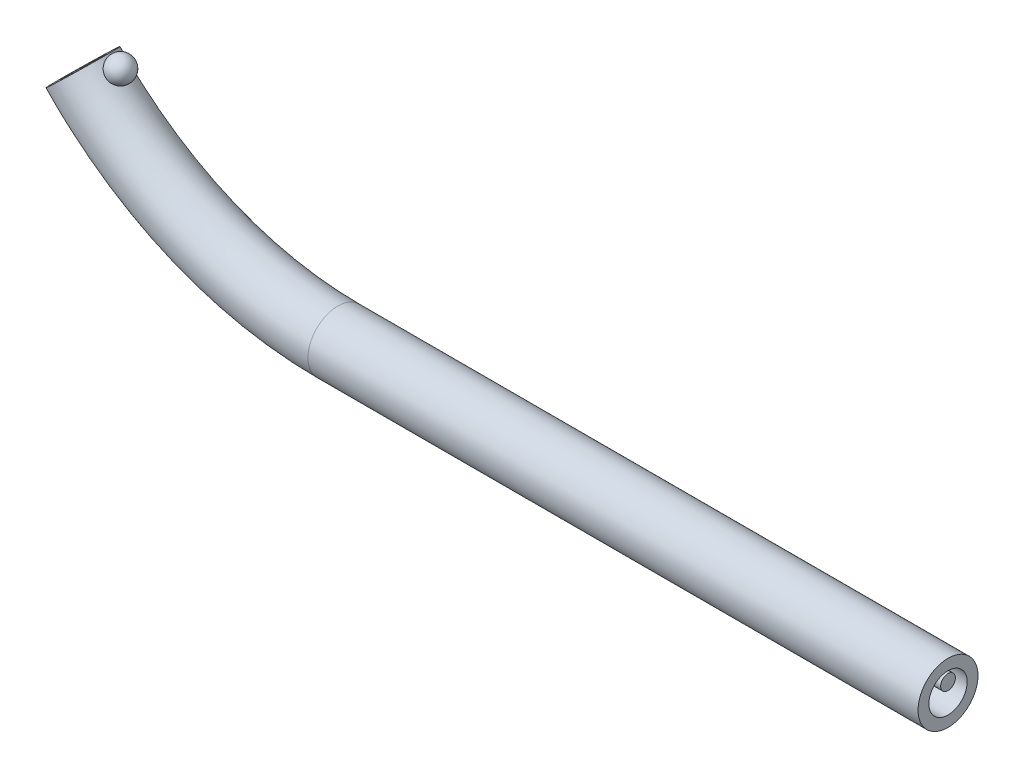
ISO-10303-21;
HEADER;
FILE_DESCRIPTION(('STEP AP214'),'2;1');
FILE_NAME('part.step','',(''),(''),'','','');
FILE_SCHEMA(('AUTOMOTIVE_DESIGN { 1 0 10303 214 1 1 1 1 }'));
ENDSEC;
DATA;
#1=APPLICATION_CONTEXT('core data for automotive mechanical design processes');
#2=APPLICATION_PROTOCOL_DEFINITION('international standard','automotive_design',2000,#1);
#3=PRODUCT_CONTEXT('',#1,'mechanical');
#4=PRODUCT('Part','Part','',(#3));
#5=PRODUCT_RELATED_PRODUCT_CATEGORY('part','',(#4));
#6=PRODUCT_DEFINITION_FORMATION('','',#4);
#7=PRODUCT_DEFINITION_CONTEXT('part definition',#1,'design');
#8=PRODUCT_DEFINITION('design','',#6,#7);
#9=PRODUCT_DEFINITION_SHAPE('','',#8);
#10=(LENGTH_UNIT() NAMED_UNIT(*) SI_UNIT(.MILLI.,.METRE.));
#11=(NAMED_UNIT(*) PLANE_ANGLE_UNIT() SI_UNIT($,.RADIAN.));
#12=(NAMED_UNIT(*) SI_UNIT($,.STERADIAN.) SOLID_ANGLE_UNIT());
#13=UNCERTAINTY_MEASURE_WITH_UNIT(LENGTH_MEASURE(1.E-05),#10,'distance_accuracy_value','');
#14=(GEOMETRIC_REPRESENTATION_CONTEXT(3) GLOBAL_UNCERTAINTY_ASSIGNED_CONTEXT((#13)) GLOBAL_UNIT_ASSIGNED_CONTEXT((#10,
#11,#12)) REPRESENTATION_CONTEXT('',''));
#15=CARTESIAN_POINT('',(0.,0.,0.));
#16=DIRECTION('',(0.,0.,1.));
#17=DIRECTION('',(1.,0.,0.));
#18=AXIS2_PLACEMENT_3D('',#15,#16,#17);
#19=CARTESIAN_POINT('',(-68.3649682129226,0.189999999999989,0.));
#20=DIRECTION('',(1.,0.,0.));
#21=DIRECTION('',(0.,1.,0.));
#22=AXIS2_PLACEMENT_3D('',#19,#20,#21);
#23=CYLINDRICAL_SURFACE('',#22,0.149999999999989);
#24=CARTESIAN_POINT('',(-68.3649682129226,0.189999999999989,0.));
#25=DIRECTION('',(-1.,0.,0.));
#26=DIRECTION('',(0.,-1.,0.));
#27=AXIS2_PLACEMENT_3D('',#24,#25,#26);
#28=CIRCLE('',#27,0.149999999999989);
#29=CARTESIAN_POINT('',(-68.3649682129226,0.0400000000000001,0.));
#30=VERTEX_POINT('',#29);
#31=EDGE_CURVE('E45',#30,#30,#28,.T.);
#32=ORIENTED_EDGE('',*,*,#31,.F.);
#33=EDGE_LOOP('',(#32));
#34=FACE_BOUND('',#33,.T.);
#35=CARTESIAN_POINT('',(-55.9542229508361,0.18999999999999,0.));
#36=DIRECTION('',(-1.,0.,0.));
#37=DIRECTION('',(0.,-1.,0.));
#38=AXIS2_PLACEMENT_3D('',#35,#36,#37);
#39=CIRCLE('',#38,0.149999999999989);
#40=CARTESIAN_POINT('',(-55.9542229508361,0.0400000000000015,0.));
#41=VERTEX_POINT('',#40);
#42=EDGE_CURVE('E11',#41,#41,#39,.T.);
#43=ORIENTED_EDGE('',*,*,#42,.T.);
#44=EDGE_LOOP('',(#43));
#45=FACE_BOUND('',#44,.T.);
#46=ADVANCED_FACE('F39',(#34,#45),#23,.T.);
#47=CARTESIAN_POINT('',(-68.3649682129226,7.15322745789866,0.));
#48=DIRECTION('',(0.,0.,-1.));
#49=DIRECTION('',(-1.,0.,0.));
#50=AXIS2_PLACEMENT_3D('',#47,#48,#49);
#51=TOROIDAL_SURFACE('',#50,6.96322745789867,0.149999999999989);
#52=CARTESIAN_POINT('',(-73.4122127025141,2.35615963549689,0.));
#53=DIRECTION('',(-0.688914422429251,0.724842685393853,0.));
#54=DIRECTION('',(-0.724842685393853,-0.688914422429251,0.));
#55=AXIS2_PLACEMENT_3D('',#52,#53,#54);
#56=CIRCLE('',#55,0.149999999999989);
#57=CARTESIAN_POINT('',(-73.5209391053232,2.25282247213251,0.));
#58=VERTEX_POINT('',#57);
#59=EDGE_CURVE('E49',#58,#58,#56,.T.);
#60=CARTESIAN_POINT('',(-68.3649682129226,7.15322745789866,0.));
#61=DIRECTION('',(0.,0.,-1.));
#62=DIRECTION('',(-1.,0.,0.));
#63=AXIS2_PLACEMENT_3D('',#60,#61,#62);
#64=CIRCLE('',#63,7.11322745789866);
#65=EDGE_CURVE('',#30,#58,#64,.T.);
#66=ORIENTED_EDGE('',*,*,#31,.T.);
#67=ORIENTED_EDGE('',*,*,#59,.F.);
#68=ORIENTED_EDGE('',*,*,#65,.T.);
#69=ORIENTED_EDGE('',*,*,#65,.F.);
#70=EDGE_LOOP('',(#66,#68,#67,#69));
#71=FACE_BOUND('',#70,.T.);
#72=ADVANCED_FACE('F58',(#71),#51,.T.);
#73=CARTESIAN_POINT('',(-55.9542229508361,0.18999999999999,0.));
#74=DIRECTION('',(-1.,0.,0.));
#75=DIRECTION('',(0.,-1.,0.));
#76=AXIS2_PLACEMENT_3D('',#73,#74,#75);
#77=PLANE('',#76);
#78=ORIENTED_EDGE('',*,*,#42,.F.);
#79=EDGE_LOOP('',(#78));
#80=FACE_BOUND('',#79,.T.);
#81=ADVANCED_FACE('F60',(#80),#77,.F.);
#82=CARTESIAN_POINT('',(-73.4122127025141,2.35615963549689,0.));
#83=DIRECTION('',(-0.688914422429251,0.724842685393853,0.));
#84=DIRECTION('',(-0.724842685393853,-0.688914422429251,0.));
#85=AXIS2_PLACEMENT_3D('',#82,#83,#84);
#86=PLANE('',#85);
#87=ORIENTED_EDGE('',*,*,#59,.T.);
#88=EDGE_LOOP('',(#87));
#89=FACE_BOUND('',#88,.T.);
#90=ADVANCED_FACE('F56',(#89),#86,.T.);
#91=CLOSED_SHELL('',(#46,#72,#81,#90));
#92=MANIFOLD_SOLID_BREP('B2',#91);
#93=CARTESIAN_POINT('',(-68.3649682129226,7.15322745789866,0.));
#94=DIRECTION('',(0.,0.,-1.));
#95=DIRECTION('',(-1.,0.,0.));
#96=AXIS2_PLACEMENT_3D('',#93,#94,#95);
#97=TOROIDAL_SURFACE('',#96,7.15322745789866,0.61);
#98=CARTESIAN_POINT('',(-72.9350725138021,2.44421356152619,-0.150413023108306));
#99=CARTESIAN_POINT('',(-72.9274957081839,2.43662587400723,-0.151074397100811));
#100=CARTESIAN_POINT('',(-72.9197123105645,2.42917045913877,-0.150903590679945));
#101=CARTESIAN_POINT('',(-72.9039370855424,2.41471588774031,-0.148896203858448));
#102=CARTESIAN_POINT('',(-72.8959452338559,2.40771678470365,-0.147059428531608));
#103=CARTESIAN_POINT('',(-72.8799822587922,2.39432283367414,-0.141710142304329));
#104=CARTESIAN_POINT('',(-72.872011209216,2.38792922670646,-0.138194275356954));
#105=CARTESIAN_POINT('',(-72.8564062378253,2.37590595423987,-0.129485323200772));
#106=CARTESIAN_POINT('',(-72.8487723381193,2.37027633878905,-0.124292128187615));
#107=CARTESIAN_POINT('',(-72.834408293673,2.36005858986416,-0.112422082536381));
#108=CARTESIAN_POINT('',(-72.8276593410652,2.35544648296375,-0.10578897460692));
#109=CARTESIAN_POINT('',(-72.8152401335314,2.3472055744453,-0.0910576840272313));
#110=CARTESIAN_POINT('',(-72.8095687055269,2.343575701641,-0.0829611135825294));
#111=CARTESIAN_POINT('',(-72.8004120464988,2.33784075810536,-0.0667032076929756));
#112=CARTESIAN_POINT('',(-72.7967345204178,2.33559556010928,-0.0586999811655228));
#113=CARTESIAN_POINT('',(-72.7907857296895,2.33200635625131,-0.0419999549877894));
#114=CARTESIAN_POINT('',(-72.7885126146171,2.33066116436382,-0.0333040850894648));
#115=CARTESIAN_POINT('',(-72.7857753670785,2.32904747269522,-0.0168391877353376));
#116=CARTESIAN_POINT('',(-72.7850974862717,2.32865159017432,-0.0091175470907518));
#117=CARTESIAN_POINT('',(-72.784953838651,2.32856741796022,0.00633975486477577));
#118=CARTESIAN_POINT('',(-72.7854875811413,2.32887884181465,0.0140754092324622));
#119=CARTESIAN_POINT('',(-72.787658627088,2.33015707983745,0.0288294453296819));
#120=CARTESIAN_POINT('',(-72.7892243257361,2.33108139089389,0.0358623207604938));
#121=CARTESIAN_POINT('',(-72.7932967958244,2.33351742246713,0.049541369883499));
#122=CARTESIAN_POINT('',(-72.7958036464945,2.33502919243888,0.0561875109644714));
#123=CARTESIAN_POINT('',(-72.801752109688,2.33867952663617,0.0692136796547517));
#124=CARTESIAN_POINT('',(-72.8052280405855,2.34084139100407,0.0755713932659163));
#125=CARTESIAN_POINT('',(-72.8128996859445,2.34571932153059,0.0876008953864975));
#126=CARTESIAN_POINT('',(-72.817095673118,2.34843559773974,0.0932724226188176));
#127=CARTESIAN_POINT('',(-72.8265515943096,2.35471283927631,0.104459252567477));
#128=CARTESIAN_POINT('',(-72.831878223766,2.3583346671523,0.109883875030492));
#129=CARTESIAN_POINT('',(-72.8430109114352,2.36614269439916,0.119742488733299));
#130=CARTESIAN_POINT('',(-72.8488172116364,2.37032917931508,0.124175975725175));
#131=CARTESIAN_POINT('',(-72.8615500087678,2.37981801644864,0.132573499248597));
#132=CARTESIAN_POINT('',(-72.8685202673953,2.38519460940035,0.136387446044708));
#133=CARTESIAN_POINT('',(-72.8826101950362,2.39649897463136,0.142692242557121));
#134=CARTESIAN_POINT('',(-72.8897299379058,2.40242702458124,0.145182421444006));
#135=CARTESIAN_POINT('',(-72.904731416516,2.41542861572641,0.149047973450483));
#136=CARTESIAN_POINT('',(-72.9126078842276,2.42255579513315,0.150264666394089));
#137=CARTESIAN_POINT('',(-72.9280812884039,2.43719702813464,0.151060339775959));
#138=CARTESIAN_POINT('',(-72.9356781211919,2.44471122278964,0.150638718849372));
#139=CARTESIAN_POINT('',(-72.9507796360435,2.46031635232005,0.14809191522895));
#140=CARTESIAN_POINT('',(-72.9582599423509,2.46841717469691,0.145881107183818));
#141=CARTESIAN_POINT('',(-72.9725168924855,2.48454847570753,0.139640737442108));
#142=CARTESIAN_POINT('',(-72.9792933202775,2.49257893205607,0.135610619377574));
#143=CARTESIAN_POINT('',(-72.9917815383213,2.50798710399345,0.125883789723231));
#144=CARTESIAN_POINT('',(-72.9975187053542,2.51537705092829,0.120239370270059));
#145=CARTESIAN_POINT('',(-73.0080051398247,2.52935732486825,0.107290458100838));
#146=CARTESIAN_POINT('',(-73.0127560807458,2.53594899837528,0.0999888222648693));
#147=CARTESIAN_POINT('',(-73.0200531285415,2.54635632033024,0.08592132232848));
#148=CARTESIAN_POINT('',(-73.0228526462211,2.55045152327995,0.0794920305448037));
#149=CARTESIAN_POINT('',(-73.0277559976559,2.55774272870609,0.0658978249066483));
#150=CARTESIAN_POINT('',(-73.0298602657109,2.56093929234625,0.0587333739621355));
#151=CARTESIAN_POINT('',(-73.0333228897633,2.5662566062212,0.0438000567552973));
#152=CARTESIAN_POINT('',(-73.0346774818247,2.56837192380745,0.0360283601968582));
#153=CARTESIAN_POINT('',(-73.0365783437559,2.57135346915954,0.0201525908148325));
#154=CARTESIAN_POINT('',(-73.0371249380147,2.57222019819602,0.0120486527208409));
#155=CARTESIAN_POINT('',(-73.0373787210429,2.57262193125596,-0.00347325871699637));
#156=CARTESIAN_POINT('',(-73.037156921045,2.57226959891208,-0.0108874392712568));
#157=CARTESIAN_POINT('',(-73.0360355008658,2.57050144866152,-0.0255338056120762));
#158=CARTESIAN_POINT('',(-73.0351359752336,2.5690857791008,-0.0327660166397227));
#159=CARTESIAN_POINT('',(-73.032704271209,2.56530589008592,-0.0467434194582633));
#160=CARTESIAN_POINT('',(-73.0311818170838,2.56295626560602,-0.0534943024067664));
#161=CARTESIAN_POINT('',(-73.0275438151821,2.55743341444797,-0.0664774180014244));
#162=CARTESIAN_POINT('',(-73.0254281312726,2.55425999874044,-0.0727095311752354));
#163=CARTESIAN_POINT('',(-73.0204634017327,2.54696149930035,-0.0850052269516184));
#164=CARTESIAN_POINT('',(-73.0175702531992,2.54278175032319,-0.0910183875645603));
#165=CARTESIAN_POINT('',(-73.0112070137739,2.53381756252625,-0.102231633505555));
#166=CARTESIAN_POINT('',(-73.0077366636358,2.5290328522245,-0.107431351435216));
#167=CARTESIAN_POINT('',(-72.99979082346,2.51837855617267,-0.117591868606859));
#168=CARTESIAN_POINT('',(-72.9952432805043,2.51244885139777,-0.122433206275144));
#169=CARTESIAN_POINT('',(-72.9855691684023,2.50025705034086,-0.130985211376816));
#170=CARTESIAN_POINT('',(-72.9804422899068,2.49399477743157,-0.134695270791241));
#171=CARTESIAN_POINT('',(-72.9689546704015,2.48045564573565,-0.141406123952094));
#172=CARTESIAN_POINT('',(-72.9625211492631,2.47315745873973,-0.144239786188686));
#173=CARTESIAN_POINT('',(-72.9491436684283,2.45860501025208,-0.148432505555004));
#174=CARTESIAN_POINT('',(-72.9421994858823,2.45135076945084,-0.149790914766512));
#175=CARTESIAN_POINT('',(-72.9350725138021,2.44421356152619,-0.150413023108306));
#176=B_SPLINE_CURVE_WITH_KNOTS('',3,(#98,#99,#100,#101,#102,#103,#104,#105,#106,#107,#108,#109,
#110,#111,#112,#113,#114,#115,#116,#117,#118,#119,#120,#121,#122,#123,#124,#125,#126,#127,#128,
#129,#130,#131,#132,#133,#134,#135,#136,#137,#138,#139,#140,#141,#142,#143,#144,#145,#146,#147,
#148,#149,#150,#151,#152,#153,#154,#155,#156,#157,#158,#159,#160,#161,#162,#163,#164,#165,#166,
#167,#168,#169,#170,#171,#172,#173,#174,#175),.UNSPECIFIED.,.T.,.F.,(4,2,2,2,2,2,2,2,2,2,2,2,2,
2,2,2,2,2,2,2,2,2,2,2,2,2,2,2,2,2,2,2,2,2,2,2,2,2,4),(0.,0.0321971127661143,0.0643979932321,
0.0966635055796532,0.128931130580075,0.16032939267867,0.191693273776942,0.218797942689927,
0.245866822418698,0.269028628146175,0.292181055234889,0.313875630004328,0.335572031517035,
0.358164155125296,0.380764854174022,0.40592895890375,0.431105837079834,0.459770107249315,
0.48844888944105,0.520383918719746,0.552330671281903,0.585903636613624,0.619486875944226,
0.652086106413129,0.684629560169973,0.708890731087477,0.733136718065842,0.757503358597786,
0.781860213929593,0.804028496797042,0.82619368754643,0.848025322461572,0.869861971357563,
0.893389598121948,0.916927820851358,0.943533800317991,0.970154054381866,1.00042634060864,
1.03071191678864),.UNSPECIFIED.);
#177=CARTESIAN_POINT('',(-72.9350725138021,2.44421356152619,-0.150413023108306));
#178=VERTEX_POINT('',#177);
#179=EDGE_CURVE('E99',#178,#178,#176,.T.);
#180=ORIENTED_EDGE('',*,*,#179,.T.);
#181=EDGE_LOOP('',(#180));
#182=FACE_BOUND('',#181,.T.);
#183=CARTESIAN_POINT('',(-68.3649682129226,0.,0.));
#184=DIRECTION('',(1.,0.,0.));
#185=DIRECTION('',(0.,0.,-1.));
#186=AXIS2_PLACEMENT_3D('',#183,#184,#185);
#187=CIRCLE('',#186,0.61);
#188=CARTESIAN_POINT('',(-68.3649682129226,0.,-0.61));
#189=VERTEX_POINT('',#188);
#190=EDGE_CURVE('E110',#189,#189,#187,.T.);
#191=ORIENTED_EDGE('',*,*,#190,.F.);
#192=EDGE_LOOP('',(#191));
#193=FACE_BOUND('',#192,.T.);
#194=CARTESIAN_POINT('',(-73.5499328127389,2.22526589523535,0.));
#195=DIRECTION('',(0.688914422429251,-0.724842685393853,0.));
#196=DIRECTION('',(0.,0.,-1.));
#197=AXIS2_PLACEMENT_3D('',#194,#195,#196);
#198=CIRCLE('',#197,0.61);
#199=CARTESIAN_POINT('',(-73.5499328127389,2.22526589523535,-0.61));
#200=VERTEX_POINT('',#199);
#201=EDGE_CURVE('E38',#200,#200,#198,.T.);
#202=ORIENTED_EDGE('',*,*,#201,.T.);
#203=EDGE_LOOP('',(#202));
#204=FACE_BOUND('',#203,.T.);
#205=ADVANCED_FACE('F95',(#182,#193,#204),#97,.T.);
#206=CARTESIAN_POINT('',(-68.3649682129226,7.15322745789866,0.));
#207=DIRECTION('',(0.,0.,-1.));
#208=DIRECTION('',(-1.,0.,0.));
#209=AXIS2_PLACEMENT_3D('',#206,#207,#208);
#210=TOROIDAL_SURFACE('',#209,7.15322745789866,0.39);
#211=CARTESIAN_POINT('',(-68.3649682129226,0.,0.));
#212=DIRECTION('',(1.,0.,0.));
#213=DIRECTION('',(0.,0.,-1.));
#214=AXIS2_PLACEMENT_3D('',#211,#212,#213);
#215=CIRCLE('',#214,0.39);
#216=CARTESIAN_POINT('',(-68.3649682129226,-0.39,0.));
#217=VERTEX_POINT('',#216);
#218=EDGE_CURVE('E115',#217,#217,#215,.T.);
#219=CARTESIAN_POINT('',(-73.5499328127389,2.22526589523535,0.));
#220=DIRECTION('',(0.688914422429251,-0.724842685393853,0.));
#221=DIRECTION('',(0.,0.,-1.));
#222=AXIS2_PLACEMENT_3D('',#219,#220,#221);
#223=CIRCLE('',#222,0.39);
#224=CARTESIAN_POINT('',(-73.8326214600425,1.95658927048794,0.));
#225=VERTEX_POINT('',#224);
#226=EDGE_CURVE('E106',#225,#225,#223,.T.);
#227=CARTESIAN_POINT('',(-68.3649682129226,7.15322745789866,0.));
#228=DIRECTION('',(0.,0.,-1.));
#229=DIRECTION('',(-1.,0.,0.));
#230=AXIS2_PLACEMENT_3D('',#227,#228,#229);
#231=CIRCLE('',#230,7.54322745789866);
#232=EDGE_CURVE('',#217,#225,#231,.T.);
#233=ORIENTED_EDGE('',*,*,#218,.T.);
#234=ORIENTED_EDGE('',*,*,#226,.F.);
#235=ORIENTED_EDGE('',*,*,#232,.T.);
#236=ORIENTED_EDGE('',*,*,#232,.F.);
#237=EDGE_LOOP('',(#233,#235,#234,#236));
#238=FACE_BOUND('',#237,.T.);
#239=ADVANCED_FACE('F141',(#238),#210,.F.);
#240=CARTESIAN_POINT('',(-68.3649682129226,0.,0.));
#241=DIRECTION('',(1.,0.,0.));
#242=DIRECTION('',(0.,0.,-1.));
#243=AXIS2_PLACEMENT_3D('',#240,#241,#242);
#244=CYLINDRICAL_SURFACE('',#243,0.39);
#245=ORIENTED_EDGE('',*,*,#218,.F.);
#246=EDGE_LOOP('',(#245));
#247=FACE_BOUND('',#246,.T.);
#248=CARTESIAN_POINT('',(-55.9542229508361,0.,0.));
#249=DIRECTION('',(1.,0.,0.));
#250=DIRECTION('',(0.,0.,-1.));
#251=AXIS2_PLACEMENT_3D('',#248,#249,#250);
#252=CIRCLE('',#251,0.39);
#253=CARTESIAN_POINT('',(-55.9542229508361,0.,-0.39));
#254=VERTEX_POINT('',#253);
#255=EDGE_CURVE('E121',#254,#254,#252,.T.);
#256=ORIENTED_EDGE('',*,*,#255,.T.);
#257=EDGE_LOOP('',(#256));
#258=FACE_BOUND('',#257,.T.);
#259=ADVANCED_FACE('F146',(#247,#258),#244,.F.);
#260=CARTESIAN_POINT('',(-68.3649682129226,0.,0.));
#261=DIRECTION('',(1.,0.,0.));
#262=DIRECTION('',(0.,0.,-1.));
#263=AXIS2_PLACEMENT_3D('',#260,#261,#262);
#264=CYLINDRICAL_SURFACE('',#263,0.61);
#265=ORIENTED_EDGE('',*,*,#190,.T.);
#266=EDGE_LOOP('',(#265));
#267=FACE_BOUND('',#266,.T.);
#268=CARTESIAN_POINT('',(-55.9542229508361,0.,0.));
#269=DIRECTION('',(1.,0.,0.));
#270=DIRECTION('',(0.,0.,-1.));
#271=AXIS2_PLACEMENT_3D('',#268,#269,#270);
#272=CIRCLE('',#271,0.61);
#273=CARTESIAN_POINT('',(-55.9542229508361,0.,-0.61));
#274=VERTEX_POINT('',#273);
#275=EDGE_CURVE('E118',#274,#274,#272,.T.);
#276=ORIENTED_EDGE('',*,*,#275,.F.);
#277=EDGE_LOOP('',(#276));
#278=FACE_BOUND('',#277,.T.);
#279=ADVANCED_FACE('F151',(#267,#278),#264,.T.);
#280=CARTESIAN_POINT('',(-73.5499328127389,2.22526589523535,0.));
#281=DIRECTION('',(0.688914422429251,-0.724842685393853,0.));
#282=DIRECTION('',(0.,0.,-1.));
#283=AXIS2_PLACEMENT_3D('',#280,#281,#282);
#284=PLANE('',#283);
#285=ORIENTED_EDGE('',*,*,#226,.T.);
#286=EDGE_LOOP('',(#285));
#287=FACE_BOUND('',#286,.T.);
#288=ORIENTED_EDGE('',*,*,#201,.F.);
#289=EDGE_LOOP('',(#288));
#290=FACE_BOUND('',#289,.T.);
#291=ADVANCED_FACE('F136',(#287,#290),#284,.F.);
#292=CARTESIAN_POINT('',(-55.9542229508361,0.,0.));
#293=DIRECTION('',(1.,0.,0.));
#294=DIRECTION('',(0.,0.,-1.));
#295=AXIS2_PLACEMENT_3D('',#292,#293,#294);
#296=PLANE('',#295);
#297=ORIENTED_EDGE('',*,*,#275,.T.);
#298=EDGE_LOOP('',(#297));
#299=FACE_BOUND('',#298,.T.);
#300=ORIENTED_EDGE('',*,*,#255,.F.);
#301=EDGE_LOOP('',(#300));
#302=FACE_BOUND('',#301,.T.);
#303=ADVANCED_FACE('F132',(#299,#302),#296,.T.);
#304=CARTESIAN_POINT('',(-72.7873645897432,2.57859470474387,0.));
#305=DIRECTION('',(-0.646795710542048,-0.762663299775469,0.));
#306=DIRECTION('',(0.762663299775469,-0.646795710542048,0.));
#307=AXIS2_PLACEMENT_3D('',#304,#305,#306);
#308=SPHERICAL_SURFACE('',#307,0.25);
#309=ORIENTED_EDGE('',*,*,#179,.F.);
#310=EDGE_LOOP('',(#309));
#311=FACE_BOUND('',#310,.T.);
#312=ADVANCED_FACE('F130',(#311),#308,.T.);
#313=CLOSED_SHELL('',(#205,#239,#259,#279,#291,#303,#312));
#314=MANIFOLD_SOLID_BREP('B6',#313);
#315=ADVANCED_BREP_SHAPE_REPRESENTATION('',(#18,#92,#314),#14);
#316=SHAPE_DEFINITION_REPRESENTATION(#9,#315);
ENDSEC;
END-ISO-10303-21;
